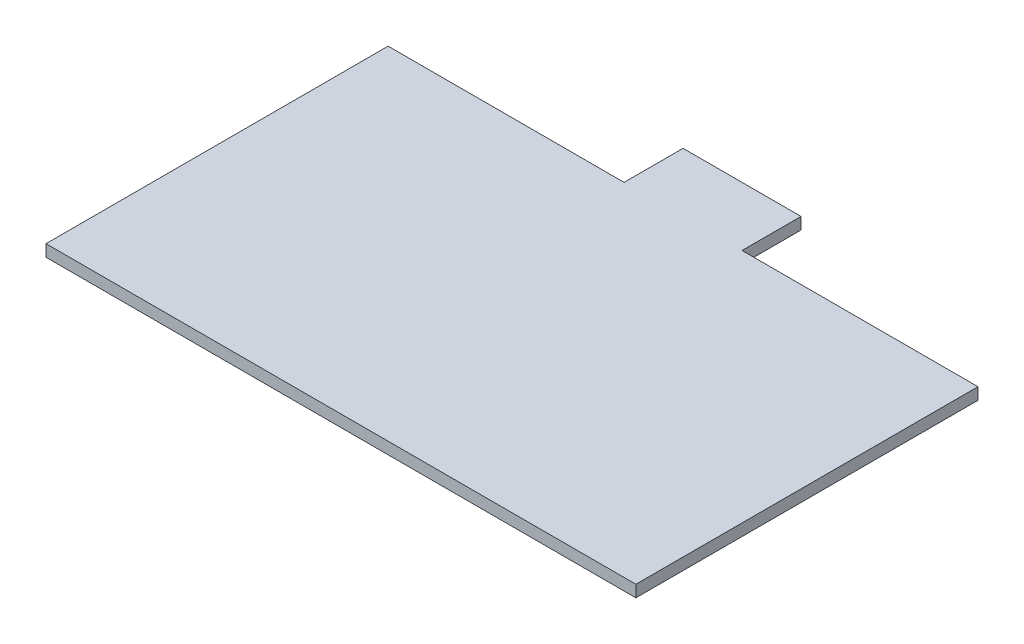
ISO-10303-21;
HEADER;
FILE_DESCRIPTION(('STEP AP214'),'2;1');
FILE_NAME('part.step','',(''),(''),'','','');
FILE_SCHEMA(('AUTOMOTIVE_DESIGN { 1 0 10303 214 1 1 1 1 }'));
ENDSEC;
DATA;
#1=APPLICATION_CONTEXT('core data for automotive mechanical design processes');
#2=APPLICATION_PROTOCOL_DEFINITION('international standard','automotive_design',2000,#1);
#3=PRODUCT_CONTEXT('',#1,'mechanical');
#4=PRODUCT('Part','Part','',(#3));
#5=PRODUCT_RELATED_PRODUCT_CATEGORY('part','',(#4));
#6=PRODUCT_DEFINITION_FORMATION('','',#4);
#7=PRODUCT_DEFINITION_CONTEXT('part definition',#1,'design');
#8=PRODUCT_DEFINITION('design','',#6,#7);
#9=PRODUCT_DEFINITION_SHAPE('','',#8);
#10=(LENGTH_UNIT() NAMED_UNIT(*) SI_UNIT(.MILLI.,.METRE.));
#11=(NAMED_UNIT(*) PLANE_ANGLE_UNIT() SI_UNIT($,.RADIAN.));
#12=(NAMED_UNIT(*) SI_UNIT($,.STERADIAN.) SOLID_ANGLE_UNIT());
#13=UNCERTAINTY_MEASURE_WITH_UNIT(LENGTH_MEASURE(1.E-05),#10,'distance_accuracy_value','');
#14=(GEOMETRIC_REPRESENTATION_CONTEXT(3) GLOBAL_UNCERTAINTY_ASSIGNED_CONTEXT((#13)) GLOBAL_UNIT_ASSIGNED_CONTEXT((#10,
#11,#12)) REPRESENTATION_CONTEXT('',''));
#15=CARTESIAN_POINT('',(0.,0.,0.));
#16=DIRECTION('',(0.,0.,1.));
#17=DIRECTION('',(1.,0.,0.));
#18=AXIS2_PLACEMENT_3D('',#15,#16,#17);
#19=CARTESIAN_POINT('',(4.99999999999999,1.,0.));
#20=DIRECTION('',(1.,0.,0.));
#21=DIRECTION('',(0.,0.,-1.));
#22=AXIS2_PLACEMENT_3D('',#19,#20,#21);
#23=PLANE('',#22);
#24=DIRECTION('',(0.,0.,1.));
#25=VECTOR('',#24,1.);
#26=CARTESIAN_POINT('',(4.99999999999999,0.,0.));
#27=LINE('',#26,#25);
#28=CARTESIAN_POINT('',(4.99999999999999,0.,-19.5));
#29=VERTEX_POINT('',#28);
#30=CARTESIAN_POINT('',(4.99999999999999,0.,-14.5));
#31=VERTEX_POINT('',#30);
#32=EDGE_CURVE('E138',#29,#31,#27,.T.);
#33=ORIENTED_EDGE('',*,*,#32,.F.);
#34=DIRECTION('',(0.,-1.,0.));
#35=VECTOR('',#34,1.);
#36=CARTESIAN_POINT('',(4.99999999999999,1.,-19.5));
#37=LINE('',#36,#35);
#38=CARTESIAN_POINT('',(4.99999999999999,1.,-19.5));
#39=VERTEX_POINT('',#38);
#40=EDGE_CURVE('E11',#39,#29,#37,.T.);
#41=ORIENTED_EDGE('',*,*,#40,.F.);
#42=DIRECTION('',(0.,0.,1.));
#43=VECTOR('',#42,1.);
#44=CARTESIAN_POINT('',(4.99999999999999,1.,0.));
#45=LINE('',#44,#43);
#46=CARTESIAN_POINT('',(4.99999999999999,1.,-14.5));
#47=VERTEX_POINT('',#46);
#48=EDGE_CURVE('E193',#39,#47,#45,.T.);
#49=ORIENTED_EDGE('',*,*,#48,.T.);
#50=DIRECTION('',(0.,-1.,0.));
#51=VECTOR('',#50,1.);
#52=CARTESIAN_POINT('',(4.99999999999999,1.,-14.5));
#53=LINE('',#52,#51);
#54=EDGE_CURVE('E92',#47,#31,#53,.T.);
#55=ORIENTED_EDGE('',*,*,#54,.T.);
#56=EDGE_LOOP('',(#33,#41,#49,#55));
#57=FACE_BOUND('',#56,.T.);
#58=ADVANCED_FACE('F41',(#57),#23,.T.);
#59=CARTESIAN_POINT('',(0.,1.,-19.5));
#60=DIRECTION('',(0.,0.,-1.));
#61=DIRECTION('',(-1.,0.,0.));
#62=AXIS2_PLACEMENT_3D('',#59,#60,#61);
#63=PLANE('',#62);
#64=DIRECTION('',(1.,0.,0.));
#65=VECTOR('',#64,1.);
#66=CARTESIAN_POINT('',(0.,0.,-19.5));
#67=LINE('',#66,#65);
#68=CARTESIAN_POINT('',(-5.00000000000001,0.,-19.5));
#69=VERTEX_POINT('',#68);
#70=EDGE_CURVE('E142',#69,#29,#67,.T.);
#71=ORIENTED_EDGE('',*,*,#70,.F.);
#72=DIRECTION('',(0.,-1.,0.));
#73=VECTOR('',#72,1.);
#74=CARTESIAN_POINT('',(-5.00000000000001,1.,-19.5));
#75=LINE('',#74,#73);
#76=CARTESIAN_POINT('',(-5.00000000000001,1.,-19.5));
#77=VERTEX_POINT('',#76);
#78=EDGE_CURVE('E50',#77,#69,#75,.T.);
#79=ORIENTED_EDGE('',*,*,#78,.F.);
#80=DIRECTION('',(1.,0.,0.));
#81=VECTOR('',#80,1.);
#82=CARTESIAN_POINT('',(0.,1.,-19.5));
#83=LINE('',#82,#81);
#84=EDGE_CURVE('E189',#77,#39,#83,.T.);
#85=ORIENTED_EDGE('',*,*,#84,.T.);
#86=ORIENTED_EDGE('',*,*,#40,.T.);
#87=EDGE_LOOP('',(#71,#79,#85,#86));
#88=FACE_BOUND('',#87,.T.);
#89=ADVANCED_FACE('F188',(#88),#63,.T.);
#90=CARTESIAN_POINT('',(-5.,1.,0.));
#91=DIRECTION('',(1.,0.,0.));
#92=DIRECTION('',(0.,0.,-1.));
#93=AXIS2_PLACEMENT_3D('',#90,#91,#92);
#94=PLANE('',#93);
#95=DIRECTION('',(0.,0.,1.));
#96=VECTOR('',#95,1.);
#97=CARTESIAN_POINT('',(-5.,0.,0.));
#98=LINE('',#97,#96);
#99=CARTESIAN_POINT('',(-5.00000000000001,0.,-14.5));
#100=VERTEX_POINT('',#99);
#101=EDGE_CURVE('E146',#69,#100,#98,.T.);
#102=ORIENTED_EDGE('',*,*,#101,.T.);
#103=DIRECTION('',(0.,-1.,0.));
#104=VECTOR('',#103,1.);
#105=CARTESIAN_POINT('',(-5.00000000000001,1.,-14.5));
#106=LINE('',#105,#104);
#107=CARTESIAN_POINT('',(-5.00000000000001,1.,-14.5));
#108=VERTEX_POINT('',#107);
#109=EDGE_CURVE('E171',#108,#100,#106,.T.);
#110=ORIENTED_EDGE('',*,*,#109,.F.);
#111=DIRECTION('',(0.,0.,1.));
#112=VECTOR('',#111,1.);
#113=CARTESIAN_POINT('',(-5.,1.,0.));
#114=LINE('',#113,#112);
#115=EDGE_CURVE('E180',#77,#108,#114,.T.);
#116=ORIENTED_EDGE('',*,*,#115,.F.);
#117=ORIENTED_EDGE('',*,*,#78,.T.);
#118=EDGE_LOOP('',(#102,#110,#116,#117));
#119=FACE_BOUND('',#118,.T.);
#120=ADVANCED_FACE('F178',(#119),#94,.F.);
#121=CARTESIAN_POINT('',(0.,1.,-14.5));
#122=DIRECTION('',(0.,0.,1.));
#123=DIRECTION('',(1.,0.,0.));
#124=AXIS2_PLACEMENT_3D('',#121,#122,#123);
#125=PLANE('',#124);
#126=DIRECTION('',(-1.,0.,0.));
#127=VECTOR('',#126,1.);
#128=CARTESIAN_POINT('',(0.,0.,-14.5));
#129=LINE('',#128,#127);
#130=CARTESIAN_POINT('',(-25.,0.,-14.5));
#131=VERTEX_POINT('',#130);
#132=EDGE_CURVE('E149',#100,#131,#129,.T.);
#133=ORIENTED_EDGE('',*,*,#132,.T.);
#134=DIRECTION('',(0.,-1.,0.));
#135=VECTOR('',#134,1.);
#136=CARTESIAN_POINT('',(-25.,1.,-14.5));
#137=LINE('',#136,#135);
#138=CARTESIAN_POINT('',(-25.,1.,-14.5));
#139=VERTEX_POINT('',#138);
#140=EDGE_CURVE('E168',#139,#131,#137,.T.);
#141=ORIENTED_EDGE('',*,*,#140,.F.);
#142=DIRECTION('',(-1.,0.,0.));
#143=VECTOR('',#142,1.);
#144=CARTESIAN_POINT('',(0.,1.,-14.5));
#145=LINE('',#144,#143);
#146=EDGE_CURVE('E134',#108,#139,#145,.T.);
#147=ORIENTED_EDGE('',*,*,#146,.F.);
#148=ORIENTED_EDGE('',*,*,#109,.T.);
#149=EDGE_LOOP('',(#133,#141,#147,#148));
#150=FACE_BOUND('',#149,.T.);
#151=ADVANCED_FACE('F205',(#150),#125,.F.);
#152=CARTESIAN_POINT('',(-25.,1.,0.));
#153=DIRECTION('',(-1.,0.,0.));
#154=DIRECTION('',(0.,0.,1.));
#155=AXIS2_PLACEMENT_3D('',#152,#153,#154);
#156=PLANE('',#155);
#157=DIRECTION('',(0.,0.,-1.));
#158=VECTOR('',#157,1.);
#159=CARTESIAN_POINT('',(-25.,0.,0.));
#160=LINE('',#159,#158);
#161=CARTESIAN_POINT('',(-25.,0.,14.5));
#162=VERTEX_POINT('',#161);
#163=EDGE_CURVE('E153',#162,#131,#160,.T.);
#164=ORIENTED_EDGE('',*,*,#163,.F.);
#165=DIRECTION('',(0.,-1.,0.));
#166=VECTOR('',#165,1.);
#167=CARTESIAN_POINT('',(-25.,1.,14.5));
#168=LINE('',#167,#166);
#169=CARTESIAN_POINT('',(-25.,1.,14.5));
#170=VERTEX_POINT('',#169);
#171=EDGE_CURVE('E120',#170,#162,#168,.T.);
#172=ORIENTED_EDGE('',*,*,#171,.F.);
#173=DIRECTION('',(0.,0.,-1.));
#174=VECTOR('',#173,1.);
#175=CARTESIAN_POINT('',(-25.,1.,0.));
#176=LINE('',#175,#174);
#177=EDGE_CURVE('E130',#170,#139,#176,.T.);
#178=ORIENTED_EDGE('',*,*,#177,.T.);
#179=ORIENTED_EDGE('',*,*,#140,.T.);
#180=EDGE_LOOP('',(#164,#172,#178,#179));
#181=FACE_BOUND('',#180,.T.);
#182=ADVANCED_FACE('F208',(#181),#156,.T.);
#183=CARTESIAN_POINT('',(0.,1.,14.5));
#184=DIRECTION('',(0.,0.,1.));
#185=DIRECTION('',(1.,0.,0.));
#186=AXIS2_PLACEMENT_3D('',#183,#184,#185);
#187=PLANE('',#186);
#188=DIRECTION('',(-1.,0.,0.));
#189=VECTOR('',#188,1.);
#190=CARTESIAN_POINT('',(0.,0.,14.5));
#191=LINE('',#190,#189);
#192=CARTESIAN_POINT('',(25.,0.,14.5));
#193=VERTEX_POINT('',#192);
#194=EDGE_CURVE('E118',#193,#162,#191,.T.);
#195=ORIENTED_EDGE('',*,*,#194,.F.);
#196=DIRECTION('',(0.,-1.,0.));
#197=VECTOR('',#196,1.);
#198=CARTESIAN_POINT('',(25.,1.,14.5));
#199=LINE('',#198,#197);
#200=CARTESIAN_POINT('',(25.,1.,14.5));
#201=VERTEX_POINT('',#200);
#202=EDGE_CURVE('E112',#201,#193,#199,.T.);
#203=ORIENTED_EDGE('',*,*,#202,.F.);
#204=DIRECTION('',(-1.,0.,0.));
#205=VECTOR('',#204,1.);
#206=CARTESIAN_POINT('',(0.,1.,14.5));
#207=LINE('',#206,#205);
#208=EDGE_CURVE('E116',#201,#170,#207,.T.);
#209=ORIENTED_EDGE('',*,*,#208,.T.);
#210=ORIENTED_EDGE('',*,*,#171,.T.);
#211=EDGE_LOOP('',(#195,#203,#209,#210));
#212=FACE_BOUND('',#211,.T.);
#213=ADVANCED_FACE('F114',(#212),#187,.T.);
#214=CARTESIAN_POINT('',(25.,1.,0.));
#215=DIRECTION('',(-1.,0.,0.));
#216=DIRECTION('',(0.,0.,1.));
#217=AXIS2_PLACEMENT_3D('',#214,#215,#216);
#218=PLANE('',#217);
#219=DIRECTION('',(0.,0.,-1.));
#220=VECTOR('',#219,1.);
#221=CARTESIAN_POINT('',(25.,0.,0.));
#222=LINE('',#221,#220);
#223=CARTESIAN_POINT('',(25.,0.,-14.5));
#224=VERTEX_POINT('',#223);
#225=EDGE_CURVE('E85',#193,#224,#222,.T.);
#226=ORIENTED_EDGE('',*,*,#225,.T.);
#227=DIRECTION('',(0.,-1.,0.));
#228=VECTOR('',#227,1.);
#229=CARTESIAN_POINT('',(25.,1.,-14.5));
#230=LINE('',#229,#228);
#231=CARTESIAN_POINT('',(25.,1.,-14.5));
#232=VERTEX_POINT('',#231);
#233=EDGE_CURVE('E121',#232,#224,#230,.T.);
#234=ORIENTED_EDGE('',*,*,#233,.F.);
#235=DIRECTION('',(0.,0.,-1.));
#236=VECTOR('',#235,1.);
#237=CARTESIAN_POINT('',(25.,1.,0.));
#238=LINE('',#237,#236);
#239=EDGE_CURVE('E123',#201,#232,#238,.T.);
#240=ORIENTED_EDGE('',*,*,#239,.F.);
#241=ORIENTED_EDGE('',*,*,#202,.T.);
#242=EDGE_LOOP('',(#226,#234,#240,#241));
#243=FACE_BOUND('',#242,.T.);
#244=ADVANCED_FACE('F124',(#243),#218,.F.);
#245=EDGE_CURVE('E154',#224,#31,#129,.T.);
#246=ORIENTED_EDGE('',*,*,#245,.T.);
#247=ORIENTED_EDGE('',*,*,#54,.F.);
#248=EDGE_CURVE('E58',#232,#47,#145,.T.);
#249=ORIENTED_EDGE('',*,*,#248,.F.);
#250=ORIENTED_EDGE('',*,*,#233,.T.);
#251=EDGE_LOOP('',(#246,#247,#249,#250));
#252=FACE_BOUND('',#251,.T.);
#253=ADVANCED_FACE('F217',(#252),#125,.F.);
#254=CARTESIAN_POINT('',(0.,1.,0.));
#255=DIRECTION('',(0.,1.,0.));
#256=DIRECTION('',(0.,0.,1.));
#257=AXIS2_PLACEMENT_3D('',#254,#255,#256);
#258=PLANE('',#257);
#259=ORIENTED_EDGE('',*,*,#48,.F.);
#260=ORIENTED_EDGE('',*,*,#84,.F.);
#261=ORIENTED_EDGE('',*,*,#115,.T.);
#262=ORIENTED_EDGE('',*,*,#146,.T.);
#263=ORIENTED_EDGE('',*,*,#177,.F.);
#264=ORIENTED_EDGE('',*,*,#208,.F.);
#265=ORIENTED_EDGE('',*,*,#239,.T.);
#266=ORIENTED_EDGE('',*,*,#248,.T.);
#267=EDGE_LOOP('',(#259,#260,#261,#262,#263,#264,#265,#266));
#268=FACE_BOUND('',#267,.T.);
#269=ADVANCED_FACE('F128',(#268),#258,.T.);
#270=CARTESIAN_POINT('',(0.,0.,0.));
#271=DIRECTION('',(0.,1.,0.));
#272=DIRECTION('',(0.,0.,1.));
#273=AXIS2_PLACEMENT_3D('',#270,#271,#272);
#274=PLANE('',#273);
#275=ORIENTED_EDGE('',*,*,#32,.T.);
#276=ORIENTED_EDGE('',*,*,#245,.F.);
#277=ORIENTED_EDGE('',*,*,#225,.F.);
#278=ORIENTED_EDGE('',*,*,#194,.T.);
#279=ORIENTED_EDGE('',*,*,#163,.T.);
#280=ORIENTED_EDGE('',*,*,#132,.F.);
#281=ORIENTED_EDGE('',*,*,#101,.F.);
#282=ORIENTED_EDGE('',*,*,#70,.T.);
#283=EDGE_LOOP('',(#275,#276,#277,#278,#279,#280,#281,#282));
#284=FACE_BOUND('',#283,.T.);
#285=ADVANCED_FACE('F187',(#284),#274,.F.);
#286=CLOSED_SHELL('',(#58,#89,#120,#151,#182,#213,#244,#253,#269,#285));
#287=MANIFOLD_SOLID_BREP('B2',#286);
#288=ADVANCED_BREP_SHAPE_REPRESENTATION('',(#18,#287),#14);
#289=SHAPE_DEFINITION_REPRESENTATION(#9,#288);
ENDSEC;
END-ISO-10303-21;
